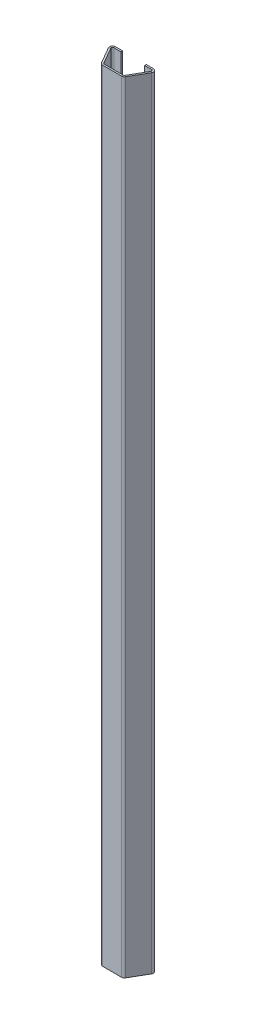
ISO-10303-21;
HEADER;
FILE_DESCRIPTION(('STEP AP214'),'2;1');
FILE_NAME('part.step','',(''),(''),'','','');
FILE_SCHEMA(('AUTOMOTIVE_DESIGN { 1 0 10303 214 1 1 1 1 }'));
ENDSEC;
DATA;
#1=APPLICATION_CONTEXT('core data for automotive mechanical design processes');
#2=APPLICATION_PROTOCOL_DEFINITION('international standard','automotive_design',2000,#1);
#3=PRODUCT_CONTEXT('',#1,'mechanical');
#4=PRODUCT('Part','Part','',(#3));
#5=PRODUCT_RELATED_PRODUCT_CATEGORY('part','',(#4));
#6=PRODUCT_DEFINITION_FORMATION('','',#4);
#7=PRODUCT_DEFINITION_CONTEXT('part definition',#1,'design');
#8=PRODUCT_DEFINITION('design','',#6,#7);
#9=PRODUCT_DEFINITION_SHAPE('','',#8);
#10=(LENGTH_UNIT() NAMED_UNIT(*) SI_UNIT(.MILLI.,.METRE.));
#11=(NAMED_UNIT(*) PLANE_ANGLE_UNIT() SI_UNIT($,.RADIAN.));
#12=(NAMED_UNIT(*) SI_UNIT($,.STERADIAN.) SOLID_ANGLE_UNIT());
#13=UNCERTAINTY_MEASURE_WITH_UNIT(LENGTH_MEASURE(1.E-05),#10,'distance_accuracy_value','');
#14=(GEOMETRIC_REPRESENTATION_CONTEXT(3) GLOBAL_UNCERTAINTY_ASSIGNED_CONTEXT((#13)) GLOBAL_UNIT_ASSIGNED_CONTEXT((#10,
#11,#12)) REPRESENTATION_CONTEXT('',''));
#15=CARTESIAN_POINT('',(0.,0.,0.));
#16=DIRECTION('',(0.,0.,1.));
#17=DIRECTION('',(1.,0.,0.));
#18=AXIS2_PLACEMENT_3D('',#15,#16,#17);
#19=CARTESIAN_POINT('',(-43.9170962313451,1810.,-52.0333209967908));
#20=DIRECTION('',(0.,1.,0.));
#21=DIRECTION('',(0.,0.,1.));
#22=AXIS2_PLACEMENT_3D('',#19,#20,#21);
#23=PLANE('',#22);
#24=DIRECTION('',(0.,0.,1.));
#25=VECTOR('',#24,1.);
#26=CARTESIAN_POINT('',(-43.9170962313451,1810.,-52.0333209967908));
#27=LINE('',#26,#25);
#28=CARTESIAN_POINT('',(-43.9170962313451,1810.,-52.0333209967908));
#29=VERTEX_POINT('',#28);
#30=CARTESIAN_POINT('',(-43.9170962313451,1810.,-48.0333209967908));
#31=VERTEX_POINT('',#30);
#32=EDGE_CURVE('E11',#29,#31,#27,.T.);
#33=ORIENTED_EDGE('',*,*,#32,.F.);
#34=CARTESIAN_POINT('',(-43.9170962313451,1810.,-45.0333209967908));
#35=DIRECTION('',(0.,-1.,0.));
#36=DIRECTION('',(0.,0.,-1.));
#37=AXIS2_PLACEMENT_3D('',#34,#35,#36);
#38=CIRCLE('',#37,7.);
#39=CARTESIAN_POINT('',(-49.9792740578362,1810.,-41.5333209967909));
#40=VERTEX_POINT('',#39);
#41=EDGE_CURVE('E362',#40,#29,#38,.T.);
#42=ORIENTED_EDGE('',*,*,#41,.F.);
#43=DIRECTION('',(-0.866025403784439,0.,0.499999999999999));
#44=VECTOR('',#43,1.);
#45=CARTESIAN_POINT('',(-46.5151724426984,1810.,-43.5333209967908));
#46=LINE('',#45,#44);
#47=CARTESIAN_POINT('',(-46.5151724426984,1810.,-43.5333209967908));
#48=VERTEX_POINT('',#47);
#49=EDGE_CURVE('E49',#48,#40,#46,.T.);
#50=ORIENTED_EDGE('',*,*,#49,.F.);
#51=CARTESIAN_POINT('',(-43.9170962313451,1810.,-45.0333209967908));
#52=DIRECTION('',(0.,1.,0.));
#53=DIRECTION('',(1.,0.,0.));
#54=AXIS2_PLACEMENT_3D('',#51,#52,#53);
#55=CIRCLE('',#54,3.);
#56=EDGE_CURVE('E221',#48,#31,#55,.F.);
#57=ORIENTED_EDGE('',*,*,#56,.T.);
#58=EDGE_LOOP('',(#33,#42,#50,#57));
#59=FACE_BOUND('',#58,.T.);
#60=ADVANCED_FACE('F41',(#59),#23,.T.);
#61=CARTESIAN_POINT('',(-46.5151724426984,1810.,-43.5333209967908));
#62=DIRECTION('',(0.,1.,0.));
#63=DIRECTION('',(0.,0.,1.));
#64=AXIS2_PLACEMENT_3D('',#61,#62,#63);
#65=PLANE('',#64);
#66=DIRECTION('',(1.,0.,0.));
#67=VECTOR('',#66,1.);
#68=CARTESIAN_POINT('',(-43.9170962313451,1810.,-52.0333209967908));
#69=LINE('',#68,#67);
#70=CARTESIAN_POINT('',(-27.5,1810.,-52.0333209967908));
#71=VERTEX_POINT('',#70);
#72=EDGE_CURVE('E366',#29,#71,#69,.T.);
#73=ORIENTED_EDGE('',*,*,#72,.F.);
#74=ORIENTED_EDGE('',*,*,#32,.T.);
#75=DIRECTION('',(1.,0.,0.));
#76=VECTOR('',#75,1.);
#77=CARTESIAN_POINT('',(-43.9170962313451,1810.,-48.0333209967908));
#78=LINE('',#77,#76);
#79=CARTESIAN_POINT('',(-27.5,1810.,-48.0333209967908));
#80=VERTEX_POINT('',#79);
#81=EDGE_CURVE('E133',#31,#80,#78,.T.);
#82=ORIENTED_EDGE('',*,*,#81,.T.);
#83=DIRECTION('',(0.,0.,1.));
#84=VECTOR('',#83,1.);
#85=CARTESIAN_POINT('',(-27.5,1810.,-52.0333209967908));
#86=LINE('',#85,#84);
#87=EDGE_CURVE('E880',#71,#80,#86,.T.);
#88=ORIENTED_EDGE('',*,*,#87,.F.);
#89=EDGE_LOOP('',(#73,#74,#82,#88));
#90=FACE_BOUND('',#89,.T.);
#91=ADVANCED_FACE('F495',(#90),#65,.T.);
#92=CARTESIAN_POINT('',(-49.9792740578362,0.,-41.5333209967909));
#93=DIRECTION('',(0.,-1.,0.));
#94=DIRECTION('',(0.,0.,-1.));
#95=AXIS2_PLACEMENT_3D('',#92,#93,#94);
#96=PLANE('',#95);
#97=DIRECTION('',(0.866025403784439,0.,-0.499999999999999));
#98=VECTOR('',#97,1.);
#99=CARTESIAN_POINT('',(-49.9792740578362,0.,-41.5333209967909));
#100=LINE('',#99,#98);
#101=CARTESIAN_POINT('',(-49.9792740578362,0.,-41.5333209967909));
#102=VERTEX_POINT('',#101);
#103=CARTESIAN_POINT('',(-46.5151724426984,0.,-43.5333209967908));
#104=VERTEX_POINT('',#103);
#105=EDGE_CURVE('E120',#102,#104,#100,.T.);
#106=ORIENTED_EDGE('',*,*,#105,.F.);
#107=CARTESIAN_POINT('',(-43.9170962313451,0.,-45.0333209967908));
#108=DIRECTION('',(0.,-1.,0.));
#109=DIRECTION('',(0.,0.,-1.));
#110=AXIS2_PLACEMENT_3D('',#107,#108,#109);
#111=CIRCLE('',#110,7.);
#112=CARTESIAN_POINT('',(-43.9170962313451,0.,-52.0333209967908));
#113=VERTEX_POINT('',#112);
#114=EDGE_CURVE('E236',#102,#113,#111,.T.);
#115=ORIENTED_EDGE('',*,*,#114,.T.);
#116=DIRECTION('',(0.,0.,-1.));
#117=VECTOR('',#116,1.);
#118=CARTESIAN_POINT('',(-43.9170962313451,0.,-48.0333209967908));
#119=LINE('',#118,#117);
#120=CARTESIAN_POINT('',(-43.9170962313451,0.,-48.0333209967908));
#121=VERTEX_POINT('',#120);
#122=EDGE_CURVE('E127',#121,#113,#119,.T.);
#123=ORIENTED_EDGE('',*,*,#122,.F.);
#124=CARTESIAN_POINT('',(-43.9170962313451,0.,-45.0333209967908));
#125=DIRECTION('',(0.,1.,0.));
#126=DIRECTION('',(1.,0.,0.));
#127=AXIS2_PLACEMENT_3D('',#124,#125,#126);
#128=CIRCLE('',#127,3.);
#129=EDGE_CURVE('E279',#104,#121,#128,.F.);
#130=ORIENTED_EDGE('',*,*,#129,.F.);
#131=EDGE_LOOP('',(#106,#115,#123,#130));
#132=FACE_BOUND('',#131,.T.);
#133=ADVANCED_FACE('F499',(#132),#96,.T.);
#134=CARTESIAN_POINT('',(-43.9170962313451,0.,-48.0333209967908));
#135=DIRECTION('',(0.,-1.,0.));
#136=DIRECTION('',(0.,0.,-1.));
#137=AXIS2_PLACEMENT_3D('',#134,#135,#136);
#138=PLANE('',#137);
#139=DIRECTION('',(-0.499999999999998,0.,-0.86602540378444));
#140=VECTOR('',#139,1.);
#141=CARTESIAN_POINT('',(-28.0207259421637,0.,-3.50000000000001));
#142=LINE('',#141,#140);
#143=CARTESIAN_POINT('',(-28.0207259421637,0.,-3.50000000000001));
#144=VERTEX_POINT('',#143);
#145=EDGE_CURVE('E238',#144,#102,#142,.T.);
#146=ORIENTED_EDGE('',*,*,#145,.T.);
#147=ORIENTED_EDGE('',*,*,#105,.T.);
#148=DIRECTION('',(-0.499999999999998,0.,-0.86602540378444));
#149=VECTOR('',#148,1.);
#150=CARTESIAN_POINT('',(-24.5566243270259,0.,-5.50000000000001));
#151=LINE('',#150,#149);
#152=CARTESIAN_POINT('',(-24.5566243270259,0.,-5.50000000000001));
#153=VERTEX_POINT('',#152);
#154=EDGE_CURVE('E277',#153,#104,#151,.T.);
#155=ORIENTED_EDGE('',*,*,#154,.F.);
#156=DIRECTION('',(-0.86602540378444,0.,0.499999999999998));
#157=VECTOR('',#156,1.);
#158=CARTESIAN_POINT('',(-24.5566243270259,0.,-5.50000000000001));
#159=LINE('',#158,#157);
#160=EDGE_CURVE('E349',#153,#144,#159,.T.);
#161=ORIENTED_EDGE('',*,*,#160,.T.);
#162=EDGE_LOOP('',(#146,#147,#155,#161));
#163=FACE_BOUND('',#162,.T.);
#164=ADVANCED_FACE('F415',(#163),#138,.T.);
#165=CARTESIAN_POINT('',(-28.0207259421637,1810.,-3.50000000000001));
#166=DIRECTION('',(0.,1.,0.));
#167=DIRECTION('',(0.,0.,1.));
#168=AXIS2_PLACEMENT_3D('',#165,#166,#167);
#169=PLANE('',#168);
#170=DIRECTION('',(0.86602540378444,0.,-0.499999999999998));
#171=VECTOR('',#170,1.);
#172=CARTESIAN_POINT('',(-28.0207259421637,1810.,-3.50000000000001));
#173=LINE('',#172,#171);
#174=CARTESIAN_POINT('',(-28.0207259421637,1810.,-3.50000000000001));
#175=VERTEX_POINT('',#174);
#176=CARTESIAN_POINT('',(-24.5566243270259,1810.,-5.50000000000001));
#177=VERTEX_POINT('',#176);
#178=EDGE_CURVE('E185',#175,#177,#173,.T.);
#179=ORIENTED_EDGE('',*,*,#178,.F.);
#180=CARTESIAN_POINT('',(-21.9585481156726,1810.,-7.));
#181=DIRECTION('',(0.,-1.,0.));
#182=DIRECTION('',(0.,0.,-1.));
#183=AXIS2_PLACEMENT_3D('',#180,#181,#182);
#184=CIRCLE('',#183,7.);
#185=CARTESIAN_POINT('',(-21.9585481156726,1810.,0.));
#186=VERTEX_POINT('',#185);
#187=EDGE_CURVE('E369',#186,#175,#184,.T.);
#188=ORIENTED_EDGE('',*,*,#187,.F.);
#189=DIRECTION('',(0.,0.,1.));
#190=VECTOR('',#189,1.);
#191=CARTESIAN_POINT('',(-21.9585481156726,1810.,-4.));
#192=LINE('',#191,#190);
#193=CARTESIAN_POINT('',(-21.9585481156726,1810.,-4.));
#194=VERTEX_POINT('',#193);
#195=EDGE_CURVE('E197',#194,#186,#192,.T.);
#196=ORIENTED_EDGE('',*,*,#195,.F.);
#197=CARTESIAN_POINT('',(-21.9585481156726,1810.,-7.));
#198=DIRECTION('',(0.,1.,0.));
#199=DIRECTION('',(1.,0.,0.));
#200=AXIS2_PLACEMENT_3D('',#197,#198,#199);
#201=CIRCLE('',#200,3.);
#202=EDGE_CURVE('E200',#194,#177,#201,.F.);
#203=ORIENTED_EDGE('',*,*,#202,.T.);
#204=EDGE_LOOP('',(#179,#188,#196,#203));
#205=FACE_BOUND('',#204,.T.);
#206=ADVANCED_FACE('F202',(#205),#169,.T.);
#207=CARTESIAN_POINT('',(-21.9585481156726,1810.,-4.));
#208=DIRECTION('',(0.,1.,0.));
#209=DIRECTION('',(0.,0.,1.));
#210=AXIS2_PLACEMENT_3D('',#207,#208,#209);
#211=PLANE('',#210);
#212=DIRECTION('',(-0.499999999999998,0.,-0.86602540378444));
#213=VECTOR('',#212,1.);
#214=CARTESIAN_POINT('',(-28.0207259421637,1810.,-3.50000000000001));
#215=LINE('',#214,#213);
#216=EDGE_CURVE('E192',#175,#40,#215,.T.);
#217=ORIENTED_EDGE('',*,*,#216,.F.);
#218=ORIENTED_EDGE('',*,*,#178,.T.);
#219=DIRECTION('',(-0.499999999999998,0.,-0.86602540378444));
#220=VECTOR('',#219,1.);
#221=CARTESIAN_POINT('',(-24.5566243270259,1810.,-5.50000000000001));
#222=LINE('',#221,#220);
#223=EDGE_CURVE('E189',#177,#48,#222,.T.);
#224=ORIENTED_EDGE('',*,*,#223,.T.);
#225=ORIENTED_EDGE('',*,*,#49,.T.);
#226=EDGE_LOOP('',(#217,#218,#224,#225));
#227=FACE_BOUND('',#226,.T.);
#228=ADVANCED_FACE('F187',(#227),#211,.T.);
#229=CARTESIAN_POINT('',(-21.9585481156726,0.,0.));
#230=DIRECTION('',(0.,-1.,0.));
#231=DIRECTION('',(0.,0.,-1.));
#232=AXIS2_PLACEMENT_3D('',#229,#230,#231);
#233=PLANE('',#232);
#234=DIRECTION('',(0.,0.,-1.));
#235=VECTOR('',#234,1.);
#236=CARTESIAN_POINT('',(-21.9585481156726,0.,0.));
#237=LINE('',#236,#235);
#238=CARTESIAN_POINT('',(-21.9585481156726,0.,0.));
#239=VERTEX_POINT('',#238);
#240=CARTESIAN_POINT('',(-21.9585481156726,0.,-4.));
#241=VERTEX_POINT('',#240);
#242=EDGE_CURVE('E351',#239,#241,#237,.T.);
#243=ORIENTED_EDGE('',*,*,#242,.F.);
#244=CARTESIAN_POINT('',(-21.9585481156726,0.,-7.));
#245=DIRECTION('',(0.,-1.,0.));
#246=DIRECTION('',(0.,0.,-1.));
#247=AXIS2_PLACEMENT_3D('',#244,#245,#246);
#248=CIRCLE('',#247,7.);
#249=EDGE_CURVE('E240',#239,#144,#248,.T.);
#250=ORIENTED_EDGE('',*,*,#249,.T.);
#251=ORIENTED_EDGE('',*,*,#160,.F.);
#252=CARTESIAN_POINT('',(-21.9585481156726,0.,-7.));
#253=DIRECTION('',(0.,1.,0.));
#254=DIRECTION('',(1.,0.,0.));
#255=AXIS2_PLACEMENT_3D('',#252,#253,#254);
#256=CIRCLE('',#255,3.);
#257=EDGE_CURVE('E213',#241,#153,#256,.F.);
#258=ORIENTED_EDGE('',*,*,#257,.F.);
#259=EDGE_LOOP('',(#243,#250,#251,#258));
#260=FACE_BOUND('',#259,.T.);
#261=ADVANCED_FACE('F413',(#260),#233,.T.);
#262=CARTESIAN_POINT('',(-24.5566243270259,0.,-5.50000000000001));
#263=DIRECTION('',(0.,-1.,0.));
#264=DIRECTION('',(0.,0.,-1.));
#265=AXIS2_PLACEMENT_3D('',#262,#263,#264);
#266=PLANE('',#265);
#267=DIRECTION('',(-1.,0.,0.));
#268=VECTOR('',#267,1.);
#269=CARTESIAN_POINT('',(-21.9585481156726,0.,0.));
#270=LINE('',#269,#268);
#271=CARTESIAN_POINT('',(21.9585481156726,0.,0.));
#272=VERTEX_POINT('',#271);
#273=EDGE_CURVE('E243',#272,#239,#270,.T.);
#274=ORIENTED_EDGE('',*,*,#273,.T.);
#275=ORIENTED_EDGE('',*,*,#242,.T.);
#276=DIRECTION('',(-1.,0.,0.));
#277=VECTOR('',#276,1.);
#278=CARTESIAN_POINT('',(-21.9585481156726,0.,-4.));
#279=LINE('',#278,#277);
#280=CARTESIAN_POINT('',(21.9585481156726,0.,-4.00000000000001));
#281=VERTEX_POINT('',#280);
#282=EDGE_CURVE('E273',#281,#241,#279,.T.);
#283=ORIENTED_EDGE('',*,*,#282,.F.);
#284=DIRECTION('',(0.,0.,1.));
#285=VECTOR('',#284,1.);
#286=CARTESIAN_POINT('',(21.9585481156726,0.,-4.00000000000001));
#287=LINE('',#286,#285);
#288=EDGE_CURVE('E341',#281,#272,#287,.T.);
#289=ORIENTED_EDGE('',*,*,#288,.T.);
#290=EDGE_LOOP('',(#274,#275,#283,#289));
#291=FACE_BOUND('',#290,.T.);
#292=ADVANCED_FACE('F474',(#291),#266,.T.);
#293=CARTESIAN_POINT('',(21.9585481156726,1810.,0.));
#294=DIRECTION('',(0.,1.,0.));
#295=DIRECTION('',(0.,0.,1.));
#296=AXIS2_PLACEMENT_3D('',#293,#294,#295);
#297=PLANE('',#296);
#298=DIRECTION('',(0.,0.,-1.));
#299=VECTOR('',#298,1.);
#300=CARTESIAN_POINT('',(21.9585481156726,1810.,0.));
#301=LINE('',#300,#299);
#302=CARTESIAN_POINT('',(21.9585481156726,1810.,0.));
#303=VERTEX_POINT('',#302);
#304=CARTESIAN_POINT('',(21.9585481156726,1810.,-4.00000000000001));
#305=VERTEX_POINT('',#304);
#306=EDGE_CURVE('E347',#303,#305,#301,.T.);
#307=ORIENTED_EDGE('',*,*,#306,.F.);
#308=CARTESIAN_POINT('',(21.9585481156726,1810.,-7.00000000000001));
#309=DIRECTION('',(0.,-1.,0.));
#310=DIRECTION('',(0.,0.,-1.));
#311=AXIS2_PLACEMENT_3D('',#308,#309,#310);
#312=CIRCLE('',#311,7.);
#313=CARTESIAN_POINT('',(28.0207259421637,1810.,-3.50000000000002));
#314=VERTEX_POINT('',#313);
#315=EDGE_CURVE('E377',#314,#303,#312,.T.);
#316=ORIENTED_EDGE('',*,*,#315,.F.);
#317=DIRECTION('',(0.86602540378444,0.,0.499999999999998));
#318=VECTOR('',#317,1.);
#319=CARTESIAN_POINT('',(24.5566243270259,1810.,-5.50000000000001));
#320=LINE('',#319,#318);
#321=CARTESIAN_POINT('',(24.5566243270259,1810.,-5.50000000000001));
#322=VERTEX_POINT('',#321);
#323=EDGE_CURVE('E345',#322,#314,#320,.T.);
#324=ORIENTED_EDGE('',*,*,#323,.F.);
#325=CARTESIAN_POINT('',(21.9585481156726,1810.,-7.00000000000001));
#326=DIRECTION('',(0.,1.,0.));
#327=DIRECTION('',(1.,0.,0.));
#328=AXIS2_PLACEMENT_3D('',#325,#326,#327);
#329=CIRCLE('',#328,3.);
#330=EDGE_CURVE('E401',#322,#305,#329,.F.);
#331=ORIENTED_EDGE('',*,*,#330,.T.);
#332=EDGE_LOOP('',(#307,#316,#324,#331));
#333=FACE_BOUND('',#332,.T.);
#334=ADVANCED_FACE('F428',(#333),#297,.T.);
#335=CARTESIAN_POINT('',(24.5566243270259,1810.,-5.50000000000001));
#336=DIRECTION('',(0.,1.,0.));
#337=DIRECTION('',(0.,0.,1.));
#338=AXIS2_PLACEMENT_3D('',#335,#336,#337);
#339=PLANE('',#338);
#340=DIRECTION('',(-1.,0.,0.));
#341=VECTOR('',#340,1.);
#342=CARTESIAN_POINT('',(-21.9585481156726,1810.,0.));
#343=LINE('',#342,#341);
#344=EDGE_CURVE('E371',#303,#186,#343,.T.);
#345=ORIENTED_EDGE('',*,*,#344,.F.);
#346=ORIENTED_EDGE('',*,*,#306,.T.);
#347=DIRECTION('',(-1.,0.,0.));
#348=VECTOR('',#347,1.);
#349=CARTESIAN_POINT('',(-21.9585481156726,1810.,-4.));
#350=LINE('',#349,#348);
#351=EDGE_CURVE('E206',#305,#194,#350,.T.);
#352=ORIENTED_EDGE('',*,*,#351,.T.);
#353=ORIENTED_EDGE('',*,*,#195,.T.);
#354=EDGE_LOOP('',(#345,#346,#352,#353));
#355=FACE_BOUND('',#354,.T.);
#356=ADVANCED_FACE('F407',(#355),#339,.T.);
#357=CARTESIAN_POINT('',(28.0207259421637,0.,-3.50000000000002));
#358=DIRECTION('',(0.,-1.,0.));
#359=DIRECTION('',(0.,0.,-1.));
#360=AXIS2_PLACEMENT_3D('',#357,#358,#359);
#361=PLANE('',#360);
#362=DIRECTION('',(-0.86602540378444,0.,-0.499999999999998));
#363=VECTOR('',#362,1.);
#364=CARTESIAN_POINT('',(28.0207259421637,0.,-3.50000000000002));
#365=LINE('',#364,#363);
#366=CARTESIAN_POINT('',(28.0207259421637,0.,-3.50000000000002));
#367=VERTEX_POINT('',#366);
#368=CARTESIAN_POINT('',(24.5566243270259,0.,-5.50000000000001));
#369=VERTEX_POINT('',#368);
#370=EDGE_CURVE('E343',#367,#369,#365,.T.);
#371=ORIENTED_EDGE('',*,*,#370,.F.);
#372=CARTESIAN_POINT('',(21.9585481156726,0.,-7.00000000000001));
#373=DIRECTION('',(0.,-1.,0.));
#374=DIRECTION('',(0.,0.,-1.));
#375=AXIS2_PLACEMENT_3D('',#372,#373,#374);
#376=CIRCLE('',#375,7.);
#377=EDGE_CURVE('E246',#367,#272,#376,.T.);
#378=ORIENTED_EDGE('',*,*,#377,.T.);
#379=ORIENTED_EDGE('',*,*,#288,.F.);
#380=CARTESIAN_POINT('',(21.9585481156726,0.,-7.00000000000001));
#381=DIRECTION('',(0.,1.,0.));
#382=DIRECTION('',(1.,0.,0.));
#383=AXIS2_PLACEMENT_3D('',#380,#381,#382);
#384=CIRCLE('',#383,3.);
#385=EDGE_CURVE('E270',#369,#281,#384,.F.);
#386=ORIENTED_EDGE('',*,*,#385,.F.);
#387=EDGE_LOOP('',(#371,#378,#379,#386));
#388=FACE_BOUND('',#387,.T.);
#389=ADVANCED_FACE('F476',(#388),#361,.T.);
#390=CARTESIAN_POINT('',(21.9585481156726,0.,-4.00000000000001));
#391=DIRECTION('',(0.,-1.,0.));
#392=DIRECTION('',(0.,0.,-1.));
#393=AXIS2_PLACEMENT_3D('',#390,#391,#392);
#394=PLANE('',#393);
#395=DIRECTION('',(-0.499999999999998,0.,0.86602540378444));
#396=VECTOR('',#395,1.);
#397=CARTESIAN_POINT('',(28.0207259421637,0.,-3.50000000000002));
#398=LINE('',#397,#396);
#399=CARTESIAN_POINT('',(49.9792740578362,0.,-41.5333209967909));
#400=VERTEX_POINT('',#399);
#401=EDGE_CURVE('E249',#400,#367,#398,.T.);
#402=ORIENTED_EDGE('',*,*,#401,.T.);
#403=ORIENTED_EDGE('',*,*,#370,.T.);
#404=DIRECTION('',(-0.499999999999998,0.,0.86602540378444));
#405=VECTOR('',#404,1.);
#406=CARTESIAN_POINT('',(24.5566243270259,0.,-5.50000000000001));
#407=LINE('',#406,#405);
#408=CARTESIAN_POINT('',(46.5151724426985,0.,-43.5333209967909));
#409=VERTEX_POINT('',#408);
#410=EDGE_CURVE('E267',#409,#369,#407,.T.);
#411=ORIENTED_EDGE('',*,*,#410,.F.);
#412=DIRECTION('',(0.866025403784438,0.,0.500000000000001));
#413=VECTOR('',#412,1.);
#414=CARTESIAN_POINT('',(46.5151724426985,0.,-43.5333209967909));
#415=LINE('',#414,#413);
#416=EDGE_CURVE('E333',#409,#400,#415,.T.);
#417=ORIENTED_EDGE('',*,*,#416,.T.);
#418=EDGE_LOOP('',(#402,#403,#411,#417));
#419=FACE_BOUND('',#418,.T.);
#420=ADVANCED_FACE('F478',(#419),#394,.T.);
#421=CARTESIAN_POINT('',(49.9792740578362,1810.,-41.5333209967909));
#422=DIRECTION('',(0.,1.,0.));
#423=DIRECTION('',(0.,0.,1.));
#424=AXIS2_PLACEMENT_3D('',#421,#422,#423);
#425=PLANE('',#424);
#426=DIRECTION('',(-0.866025403784438,0.,-0.500000000000001));
#427=VECTOR('',#426,1.);
#428=CARTESIAN_POINT('',(49.9792740578362,1810.,-41.5333209967909));
#429=LINE('',#428,#427);
#430=CARTESIAN_POINT('',(49.9792740578362,1810.,-41.5333209967909));
#431=VERTEX_POINT('',#430);
#432=CARTESIAN_POINT('',(46.5151724426985,1810.,-43.5333209967909));
#433=VERTEX_POINT('',#432);
#434=EDGE_CURVE('E339',#431,#433,#429,.T.);
#435=ORIENTED_EDGE('',*,*,#434,.F.);
#436=CARTESIAN_POINT('',(43.9170962313451,1810.,-45.0333209967909));
#437=DIRECTION('',(0.,-1.,0.));
#438=DIRECTION('',(0.,0.,-1.));
#439=AXIS2_PLACEMENT_3D('',#436,#437,#438);
#440=CIRCLE('',#439,7.00000000000001);
#441=CARTESIAN_POINT('',(43.9170962313451,1810.,-52.0333209967909));
#442=VERTEX_POINT('',#441);
#443=EDGE_CURVE('E383',#442,#431,#440,.T.);
#444=ORIENTED_EDGE('',*,*,#443,.F.);
#445=DIRECTION('',(0.,0.,-1.));
#446=VECTOR('',#445,1.);
#447=CARTESIAN_POINT('',(43.9170962313451,1810.,-48.0333209967909));
#448=LINE('',#447,#446);
#449=CARTESIAN_POINT('',(43.9170962313451,1810.,-48.0333209967909));
#450=VERTEX_POINT('',#449);
#451=EDGE_CURVE('E337',#450,#442,#448,.T.);
#452=ORIENTED_EDGE('',*,*,#451,.F.);
#453=CARTESIAN_POINT('',(43.9170962313451,1810.,-45.0333209967909));
#454=DIRECTION('',(0.,1.,0.));
#455=DIRECTION('',(1.,0.,0.));
#456=AXIS2_PLACEMENT_3D('',#453,#454,#455);
#457=CIRCLE('',#456,3.00000000000001);
#458=EDGE_CURVE('E395',#450,#433,#457,.F.);
#459=ORIENTED_EDGE('',*,*,#458,.T.);
#460=EDGE_LOOP('',(#435,#444,#452,#459));
#461=FACE_BOUND('',#460,.T.);
#462=ADVANCED_FACE('F442',(#461),#425,.T.);
#463=CARTESIAN_POINT('',(43.9170962313451,1810.,-48.0333209967909));
#464=DIRECTION('',(0.,1.,0.));
#465=DIRECTION('',(0.,0.,1.));
#466=AXIS2_PLACEMENT_3D('',#463,#464,#465);
#467=PLANE('',#466);
#468=DIRECTION('',(-0.499999999999998,0.,0.86602540378444));
#469=VECTOR('',#468,1.);
#470=CARTESIAN_POINT('',(28.0207259421637,1810.,-3.50000000000002));
#471=LINE('',#470,#469);
#472=EDGE_CURVE('E380',#431,#314,#471,.T.);
#473=ORIENTED_EDGE('',*,*,#472,.F.);
#474=ORIENTED_EDGE('',*,*,#434,.T.);
#475=DIRECTION('',(-0.499999999999998,0.,0.86602540378444));
#476=VECTOR('',#475,1.);
#477=CARTESIAN_POINT('',(24.5566243270259,1810.,-5.50000000000001));
#478=LINE('',#477,#476);
#479=EDGE_CURVE('E398',#433,#322,#478,.T.);
#480=ORIENTED_EDGE('',*,*,#479,.T.);
#481=ORIENTED_EDGE('',*,*,#323,.T.);
#482=EDGE_LOOP('',(#473,#474,#480,#481));
#483=FACE_BOUND('',#482,.T.);
#484=ADVANCED_FACE('F435',(#483),#467,.T.);
#485=CARTESIAN_POINT('',(43.9170962313451,0.,-52.0333209967909));
#486=DIRECTION('',(0.,-1.,0.));
#487=DIRECTION('',(0.,0.,-1.));
#488=AXIS2_PLACEMENT_3D('',#485,#486,#487);
#489=PLANE('',#488);
#490=DIRECTION('',(0.,0.,1.));
#491=VECTOR('',#490,1.);
#492=CARTESIAN_POINT('',(43.9170962313451,0.,-52.0333209967909));
#493=LINE('',#492,#491);
#494=CARTESIAN_POINT('',(43.9170962313451,0.,-52.0333209967909));
#495=VERTEX_POINT('',#494);
#496=CARTESIAN_POINT('',(43.9170962313451,0.,-48.0333209967909));
#497=VERTEX_POINT('',#496);
#498=EDGE_CURVE('E335',#495,#497,#493,.T.);
#499=ORIENTED_EDGE('',*,*,#498,.F.);
#500=CARTESIAN_POINT('',(43.9170962313451,0.,-45.0333209967909));
#501=DIRECTION('',(0.,-1.,0.));
#502=DIRECTION('',(0.,0.,-1.));
#503=AXIS2_PLACEMENT_3D('',#500,#501,#502);
#504=CIRCLE('',#503,7.00000000000001);
#505=EDGE_CURVE('E252',#495,#400,#504,.T.);
#506=ORIENTED_EDGE('',*,*,#505,.T.);
#507=ORIENTED_EDGE('',*,*,#416,.F.);
#508=CARTESIAN_POINT('',(43.9170962313451,0.,-45.0333209967909));
#509=DIRECTION('',(0.,1.,0.));
#510=DIRECTION('',(1.,0.,0.));
#511=AXIS2_PLACEMENT_3D('',#508,#509,#510);
#512=CIRCLE('',#511,3.00000000000001);
#513=EDGE_CURVE('E264',#497,#409,#512,.F.);
#514=ORIENTED_EDGE('',*,*,#513,.F.);
#515=EDGE_LOOP('',(#499,#506,#507,#514));
#516=FACE_BOUND('',#515,.T.);
#517=ADVANCED_FACE('F480',(#516),#489,.T.);
#518=CARTESIAN_POINT('',(46.5151724426985,0.,-43.5333209967909));
#519=DIRECTION('',(0.,-1.,0.));
#520=DIRECTION('',(0.,0.,-1.));
#521=AXIS2_PLACEMENT_3D('',#518,#519,#520);
#522=PLANE('',#521);
#523=DIRECTION('',(1.,0.,0.));
#524=VECTOR('',#523,1.);
#525=CARTESIAN_POINT('',(27.5,0.,-52.0333209967908));
#526=LINE('',#525,#524);
#527=CARTESIAN_POINT('',(27.5,0.,-52.0333209967908));
#528=VERTEX_POINT('',#527);
#529=EDGE_CURVE('E255',#528,#495,#526,.T.);
#530=ORIENTED_EDGE('',*,*,#529,.T.);
#531=ORIENTED_EDGE('',*,*,#498,.T.);
#532=DIRECTION('',(1.,0.,0.));
#533=VECTOR('',#532,1.);
#534=CARTESIAN_POINT('',(27.5,0.,-48.0333209967908));
#535=LINE('',#534,#533);
#536=CARTESIAN_POINT('',(27.5,0.,-48.0333209967908));
#537=VERTEX_POINT('',#536);
#538=EDGE_CURVE('E261',#537,#497,#535,.T.);
#539=ORIENTED_EDGE('',*,*,#538,.F.);
#540=DIRECTION('',(0.,0.,-1.));
#541=VECTOR('',#540,1.);
#542=CARTESIAN_POINT('',(27.5,0.,-48.0333209967908));
#543=LINE('',#542,#541);
#544=EDGE_CURVE('E258',#537,#528,#543,.T.);
#545=ORIENTED_EDGE('',*,*,#544,.T.);
#546=EDGE_LOOP('',(#530,#531,#539,#545));
#547=FACE_BOUND('',#546,.T.);
#548=ADVANCED_FACE('F482',(#547),#522,.T.);
#549=CARTESIAN_POINT('',(-43.9170962313451,1810.,-48.0333209967908));
#550=DIRECTION('',(0.,0.,-1.));
#551=DIRECTION('',(-1.,0.,0.));
#552=AXIS2_PLACEMENT_3D('',#549,#550,#551);
#553=PLANE('',#552);
#554=DIRECTION('',(1.,0.,0.));
#555=VECTOR('',#554,1.);
#556=CARTESIAN_POINT('',(-43.9170962313451,0.,-48.0333209967908));
#557=LINE('',#556,#555);
#558=CARTESIAN_POINT('',(-27.5,0.,-48.0333209967908));
#559=VERTEX_POINT('',#558);
#560=EDGE_CURVE('E227',#121,#559,#557,.T.);
#561=ORIENTED_EDGE('',*,*,#560,.T.);
#562=DIRECTION('',(0.,-1.,0.));
#563=VECTOR('',#562,1.);
#564=CARTESIAN_POINT('',(-27.5,1810.,-48.0333209967908));
#565=LINE('',#564,#563);
#566=EDGE_CURVE('E331',#80,#559,#565,.T.);
#567=ORIENTED_EDGE('',*,*,#566,.F.);
#568=ORIENTED_EDGE('',*,*,#81,.F.);
#569=DIRECTION('',(0.,-1.,0.));
#570=VECTOR('',#569,1.);
#571=CARTESIAN_POINT('',(-43.9170962313451,1810.,-48.0333209967908));
#572=LINE('',#571,#570);
#573=EDGE_CURVE('E223',#31,#121,#572,.T.);
#574=ORIENTED_EDGE('',*,*,#573,.T.);
#575=EDGE_LOOP('',(#561,#567,#568,#574));
#576=FACE_BOUND('',#575,.T.);
#577=ADVANCED_FACE('F484',(#576),#553,.F.);
#578=CARTESIAN_POINT('',(-27.5,1810.,-52.0333209967908));
#579=DIRECTION('',(1.,0.,0.));
#580=DIRECTION('',(0.,0.,-1.));
#581=AXIS2_PLACEMENT_3D('',#578,#579,#580);
#582=PLANE('',#581);
#583=DIRECTION('',(0.,0.,1.));
#584=VECTOR('',#583,1.);
#585=CARTESIAN_POINT('',(-27.5,0.,-52.0333209967908));
#586=LINE('',#585,#584);
#587=CARTESIAN_POINT('',(-27.5,0.,-52.0333209967908));
#588=VERTEX_POINT('',#587);
#589=EDGE_CURVE('E230',#588,#559,#586,.T.);
#590=ORIENTED_EDGE('',*,*,#589,.F.);
#591=DIRECTION('',(0.,-1.,0.));
#592=VECTOR('',#591,1.);
#593=CARTESIAN_POINT('',(-27.5,1810.,-52.0333209967908));
#594=LINE('',#593,#592);
#595=EDGE_CURVE('E329',#71,#588,#594,.T.);
#596=ORIENTED_EDGE('',*,*,#595,.F.);
#597=ORIENTED_EDGE('',*,*,#87,.T.);
#598=ORIENTED_EDGE('',*,*,#566,.T.);
#599=EDGE_LOOP('',(#590,#596,#597,#598));
#600=FACE_BOUND('',#599,.T.);
#601=ADVANCED_FACE('F490',(#600),#582,.T.);
#602=CARTESIAN_POINT('',(-43.9170962313451,1810.,-52.0333209967908));
#603=DIRECTION('',(0.,0.,-1.));
#604=DIRECTION('',(-1.,0.,0.));
#605=AXIS2_PLACEMENT_3D('',#602,#603,#604);
#606=PLANE('',#605);
#607=DIRECTION('',(1.,0.,0.));
#608=VECTOR('',#607,1.);
#609=CARTESIAN_POINT('',(-43.9170962313451,0.,-52.0333209967908));
#610=LINE('',#609,#608);
#611=EDGE_CURVE('E233',#113,#588,#610,.T.);
#612=ORIENTED_EDGE('',*,*,#611,.F.);
#613=DIRECTION('',(0.,-1.,0.));
#614=VECTOR('',#613,1.);
#615=CARTESIAN_POINT('',(-43.9170962313451,1810.,-52.0333209967908));
#616=LINE('',#615,#614);
#617=EDGE_CURVE('E326',#29,#113,#616,.T.);
#618=ORIENTED_EDGE('',*,*,#617,.F.);
#619=ORIENTED_EDGE('',*,*,#72,.T.);
#620=ORIENTED_EDGE('',*,*,#595,.T.);
#621=EDGE_LOOP('',(#612,#618,#619,#620));
#622=FACE_BOUND('',#621,.T.);
#623=ADVANCED_FACE('F556',(#622),#606,.T.);
#624=CARTESIAN_POINT('',(-43.9170962313451,1810.,-45.0333209967908));
#625=DIRECTION('',(0.,-1.,0.));
#626=DIRECTION('',(0.,0.,-1.));
#627=AXIS2_PLACEMENT_3D('',#624,#625,#626);
#628=CYLINDRICAL_SURFACE('',#627,7.);
#629=ORIENTED_EDGE('',*,*,#114,.F.);
#630=DIRECTION('',(0.,-1.,0.));
#631=VECTOR('',#630,1.);
#632=CARTESIAN_POINT('',(-49.9792740578362,1810.,-41.5333209967909));
#633=LINE('',#632,#631);
#634=EDGE_CURVE('E323',#40,#102,#633,.T.);
#635=ORIENTED_EDGE('',*,*,#634,.F.);
#636=ORIENTED_EDGE('',*,*,#41,.T.);
#637=ORIENTED_EDGE('',*,*,#617,.T.);
#638=EDGE_LOOP('',(#629,#635,#636,#637));
#639=FACE_BOUND('',#638,.T.);
#640=ADVANCED_FACE('F361',(#639),#628,.T.);
#641=CARTESIAN_POINT('',(-28.0207259421637,1810.,-3.50000000000001));
#642=DIRECTION('',(-0.86602540378444,0.,0.499999999999998));
#643=DIRECTION('',(0.499999999999998,0.,0.86602540378444));
#644=AXIS2_PLACEMENT_3D('',#641,#642,#643);
#645=PLANE('',#644);
#646=ORIENTED_EDGE('',*,*,#145,.F.);
#647=DIRECTION('',(0.,-1.,0.));
#648=VECTOR('',#647,1.);
#649=CARTESIAN_POINT('',(-28.0207259421637,1810.,-3.50000000000001));
#650=LINE('',#649,#648);
#651=EDGE_CURVE('E320',#175,#144,#650,.T.);
#652=ORIENTED_EDGE('',*,*,#651,.F.);
#653=ORIENTED_EDGE('',*,*,#216,.T.);
#654=ORIENTED_EDGE('',*,*,#634,.T.);
#655=EDGE_LOOP('',(#646,#652,#653,#654));
#656=FACE_BOUND('',#655,.T.);
#657=ADVANCED_FACE('F368',(#656),#645,.T.);
#658=CARTESIAN_POINT('',(-21.9585481156726,1810.,-7.));
#659=DIRECTION('',(0.,-1.,0.));
#660=DIRECTION('',(0.,0.,-1.));
#661=AXIS2_PLACEMENT_3D('',#658,#659,#660);
#662=CYLINDRICAL_SURFACE('',#661,7.);
#663=ORIENTED_EDGE('',*,*,#249,.F.);
#664=DIRECTION('',(0.,-1.,0.));
#665=VECTOR('',#664,1.);
#666=CARTESIAN_POINT('',(-21.9585481156726,1810.,0.));
#667=LINE('',#666,#665);
#668=EDGE_CURVE('E317',#186,#239,#667,.T.);
#669=ORIENTED_EDGE('',*,*,#668,.F.);
#670=ORIENTED_EDGE('',*,*,#187,.T.);
#671=ORIENTED_EDGE('',*,*,#651,.T.);
#672=EDGE_LOOP('',(#663,#669,#670,#671));
#673=FACE_BOUND('',#672,.T.);
#674=ADVANCED_FACE('F417',(#673),#662,.T.);
#675=CARTESIAN_POINT('',(-21.9585481156726,1810.,0.));
#676=DIRECTION('',(0.,0.,1.));
#677=DIRECTION('',(1.,0.,0.));
#678=AXIS2_PLACEMENT_3D('',#675,#676,#677);
#679=PLANE('',#678);
#680=ORIENTED_EDGE('',*,*,#273,.F.);
#681=DIRECTION('',(0.,-1.,0.));
#682=VECTOR('',#681,1.);
#683=CARTESIAN_POINT('',(21.9585481156726,1810.,0.));
#684=LINE('',#683,#682);
#685=EDGE_CURVE('E313',#303,#272,#684,.T.);
#686=ORIENTED_EDGE('',*,*,#685,.F.);
#687=ORIENTED_EDGE('',*,*,#344,.T.);
#688=ORIENTED_EDGE('',*,*,#668,.T.);
#689=EDGE_LOOP('',(#680,#686,#687,#688));
#690=FACE_BOUND('',#689,.T.);
#691=ADVANCED_FACE('F421',(#690),#679,.T.);
#692=CARTESIAN_POINT('',(21.9585481156726,1810.,-7.00000000000001));
#693=DIRECTION('',(0.,-1.,0.));
#694=DIRECTION('',(0.,0.,-1.));
#695=AXIS2_PLACEMENT_3D('',#692,#693,#694);
#696=CYLINDRICAL_SURFACE('',#695,7.);
#697=ORIENTED_EDGE('',*,*,#377,.F.);
#698=DIRECTION('',(0.,-1.,0.));
#699=VECTOR('',#698,1.);
#700=CARTESIAN_POINT('',(28.0207259421637,1810.,-3.50000000000002));
#701=LINE('',#700,#699);
#702=EDGE_CURVE('E310',#314,#367,#701,.T.);
#703=ORIENTED_EDGE('',*,*,#702,.F.);
#704=ORIENTED_EDGE('',*,*,#315,.T.);
#705=ORIENTED_EDGE('',*,*,#685,.T.);
#706=EDGE_LOOP('',(#697,#703,#704,#705));
#707=FACE_BOUND('',#706,.T.);
#708=ADVANCED_FACE('F426',(#707),#696,.T.);
#709=CARTESIAN_POINT('',(28.0207259421637,1810.,-3.50000000000002));
#710=DIRECTION('',(0.86602540378444,0.,0.499999999999998));
#711=DIRECTION('',(0.499999999999998,0.,-0.86602540378444));
#712=AXIS2_PLACEMENT_3D('',#709,#710,#711);
#713=PLANE('',#712);
#714=ORIENTED_EDGE('',*,*,#401,.F.);
#715=DIRECTION('',(0.,-1.,0.));
#716=VECTOR('',#715,1.);
#717=CARTESIAN_POINT('',(49.9792740578362,1810.,-41.5333209967909));
#718=LINE('',#717,#716);
#719=EDGE_CURVE('E307',#431,#400,#718,.T.);
#720=ORIENTED_EDGE('',*,*,#719,.F.);
#721=ORIENTED_EDGE('',*,*,#472,.T.);
#722=ORIENTED_EDGE('',*,*,#702,.T.);
#723=EDGE_LOOP('',(#714,#720,#721,#722));
#724=FACE_BOUND('',#723,.T.);
#725=ADVANCED_FACE('F433',(#724),#713,.T.);
#726=CARTESIAN_POINT('',(43.9170962313451,1810.,-45.0333209967909));
#727=DIRECTION('',(0.,-1.,0.));
#728=DIRECTION('',(0.,0.,-1.));
#729=AXIS2_PLACEMENT_3D('',#726,#727,#728);
#730=CYLINDRICAL_SURFACE('',#729,7.00000000000001);
#731=ORIENTED_EDGE('',*,*,#505,.F.);
#732=DIRECTION('',(0.,-1.,0.));
#733=VECTOR('',#732,1.);
#734=CARTESIAN_POINT('',(43.9170962313451,1810.,-52.0333209967909));
#735=LINE('',#734,#733);
#736=EDGE_CURVE('E304',#442,#495,#735,.T.);
#737=ORIENTED_EDGE('',*,*,#736,.F.);
#738=ORIENTED_EDGE('',*,*,#443,.T.);
#739=ORIENTED_EDGE('',*,*,#719,.T.);
#740=EDGE_LOOP('',(#731,#737,#738,#739));
#741=FACE_BOUND('',#740,.T.);
#742=ADVANCED_FACE('F440',(#741),#730,.T.);
#743=CARTESIAN_POINT('',(27.5,1810.,-52.0333209967908));
#744=DIRECTION('',(0.,0.,-1.));
#745=DIRECTION('',(-1.,0.,0.));
#746=AXIS2_PLACEMENT_3D('',#743,#744,#745);
#747=PLANE('',#746);
#748=ORIENTED_EDGE('',*,*,#529,.F.);
#749=DIRECTION('',(0.,-1.,0.));
#750=VECTOR('',#749,1.);
#751=CARTESIAN_POINT('',(27.5,1810.,-52.0333209967908));
#752=LINE('',#751,#750);
#753=CARTESIAN_POINT('',(27.5,1810.,-52.0333209967908));
#754=VERTEX_POINT('',#753);
#755=EDGE_CURVE('E301',#754,#528,#752,.T.);
#756=ORIENTED_EDGE('',*,*,#755,.F.);
#757=DIRECTION('',(1.,0.,0.));
#758=VECTOR('',#757,1.);
#759=CARTESIAN_POINT('',(27.5,1810.,-52.0333209967908));
#760=LINE('',#759,#758);
#761=EDGE_CURVE('E386',#754,#442,#760,.T.);
#762=ORIENTED_EDGE('',*,*,#761,.T.);
#763=ORIENTED_EDGE('',*,*,#736,.T.);
#764=EDGE_LOOP('',(#748,#756,#762,#763));
#765=FACE_BOUND('',#764,.T.);
#766=ADVANCED_FACE('F446',(#765),#747,.T.);
#767=CARTESIAN_POINT('',(27.5,1810.,-48.0333209967908));
#768=DIRECTION('',(-1.,0.,0.));
#769=DIRECTION('',(0.,0.,1.));
#770=AXIS2_PLACEMENT_3D('',#767,#768,#769);
#771=PLANE('',#770);
#772=ORIENTED_EDGE('',*,*,#544,.F.);
#773=DIRECTION('',(0.,-1.,0.));
#774=VECTOR('',#773,1.);
#775=CARTESIAN_POINT('',(27.5,1810.,-48.0333209967908));
#776=LINE('',#775,#774);
#777=CARTESIAN_POINT('',(27.5,1810.,-48.0333209967908));
#778=VERTEX_POINT('',#777);
#779=EDGE_CURVE('E298',#778,#537,#776,.T.);
#780=ORIENTED_EDGE('',*,*,#779,.F.);
#781=DIRECTION('',(0.,0.,-1.));
#782=VECTOR('',#781,1.);
#783=CARTESIAN_POINT('',(27.5,1810.,-48.0333209967908));
#784=LINE('',#783,#782);
#785=EDGE_CURVE('E389',#778,#754,#784,.T.);
#786=ORIENTED_EDGE('',*,*,#785,.T.);
#787=ORIENTED_EDGE('',*,*,#755,.T.);
#788=EDGE_LOOP('',(#772,#780,#786,#787));
#789=FACE_BOUND('',#788,.T.);
#790=ADVANCED_FACE('F452',(#789),#771,.T.);
#791=CARTESIAN_POINT('',(27.5,1810.,-48.0333209967908));
#792=DIRECTION('',(0.,0.,-1.));
#793=DIRECTION('',(-1.,0.,0.));
#794=AXIS2_PLACEMENT_3D('',#791,#792,#793);
#795=PLANE('',#794);
#796=ORIENTED_EDGE('',*,*,#538,.T.);
#797=DIRECTION('',(0.,-1.,0.));
#798=VECTOR('',#797,1.);
#799=CARTESIAN_POINT('',(43.9170962313451,1810.,-48.0333209967909));
#800=LINE('',#799,#798);
#801=EDGE_CURVE('E295',#450,#497,#800,.T.);
#802=ORIENTED_EDGE('',*,*,#801,.F.);
#803=DIRECTION('',(1.,0.,0.));
#804=VECTOR('',#803,1.);
#805=CARTESIAN_POINT('',(27.5,1810.,-48.0333209967908));
#806=LINE('',#805,#804);
#807=EDGE_CURVE('E392',#778,#450,#806,.T.);
#808=ORIENTED_EDGE('',*,*,#807,.F.);
#809=ORIENTED_EDGE('',*,*,#779,.T.);
#810=EDGE_LOOP('',(#796,#802,#808,#809));
#811=FACE_BOUND('',#810,.T.);
#812=ADVANCED_FACE('F457',(#811),#795,.F.);
#813=CARTESIAN_POINT('',(43.9170962313451,1810.,-45.0333209967909));
#814=DIRECTION('',(0.,-1.,0.));
#815=DIRECTION('',(0.,0.,-1.));
#816=AXIS2_PLACEMENT_3D('',#813,#814,#815);
#817=CYLINDRICAL_SURFACE('',#816,3.00000000000001);
#818=ORIENTED_EDGE('',*,*,#513,.T.);
#819=DIRECTION('',(0.,-1.,0.));
#820=VECTOR('',#819,1.);
#821=CARTESIAN_POINT('',(46.5151724426985,1810.,-43.5333209967909));
#822=LINE('',#821,#820);
#823=EDGE_CURVE('E292',#433,#409,#822,.T.);
#824=ORIENTED_EDGE('',*,*,#823,.F.);
#825=ORIENTED_EDGE('',*,*,#458,.F.);
#826=ORIENTED_EDGE('',*,*,#801,.T.);
#827=EDGE_LOOP('',(#818,#824,#825,#826));
#828=FACE_BOUND('',#827,.T.);
#829=ADVANCED_FACE('F462',(#828),#817,.F.);
#830=CARTESIAN_POINT('',(24.5566243270259,1810.,-5.50000000000001));
#831=DIRECTION('',(0.86602540378444,0.,0.499999999999998));
#832=DIRECTION('',(0.499999999999998,0.,-0.86602540378444));
#833=AXIS2_PLACEMENT_3D('',#830,#831,#832);
#834=PLANE('',#833);
#835=ORIENTED_EDGE('',*,*,#410,.T.);
#836=DIRECTION('',(0.,-1.,0.));
#837=VECTOR('',#836,1.);
#838=CARTESIAN_POINT('',(24.5566243270259,1810.,-5.50000000000001));
#839=LINE('',#838,#837);
#840=EDGE_CURVE('E289',#322,#369,#839,.T.);
#841=ORIENTED_EDGE('',*,*,#840,.F.);
#842=ORIENTED_EDGE('',*,*,#479,.F.);
#843=ORIENTED_EDGE('',*,*,#823,.T.);
#844=EDGE_LOOP('',(#835,#841,#842,#843));
#845=FACE_BOUND('',#844,.T.);
#846=ADVANCED_FACE('F467',(#845),#834,.F.);
#847=CARTESIAN_POINT('',(21.9585481156726,1810.,-7.00000000000001));
#848=DIRECTION('',(0.,-1.,0.));
#849=DIRECTION('',(0.,0.,-1.));
#850=AXIS2_PLACEMENT_3D('',#847,#848,#849);
#851=CYLINDRICAL_SURFACE('',#850,3.);
#852=ORIENTED_EDGE('',*,*,#385,.T.);
#853=DIRECTION('',(0.,-1.,0.));
#854=VECTOR('',#853,1.);
#855=CARTESIAN_POINT('',(21.9585481156726,1810.,-4.00000000000001));
#856=LINE('',#855,#854);
#857=EDGE_CURVE('E285',#305,#281,#856,.T.);
#858=ORIENTED_EDGE('',*,*,#857,.F.);
#859=ORIENTED_EDGE('',*,*,#330,.F.);
#860=ORIENTED_EDGE('',*,*,#840,.T.);
#861=EDGE_LOOP('',(#852,#858,#859,#860));
#862=FACE_BOUND('',#861,.T.);
#863=ADVANCED_FACE('F472',(#862),#851,.F.);
#864=CARTESIAN_POINT('',(-21.9585481156726,1810.,-4.));
#865=DIRECTION('',(0.,0.,1.));
#866=DIRECTION('',(1.,0.,0.));
#867=AXIS2_PLACEMENT_3D('',#864,#865,#866);
#868=PLANE('',#867);
#869=ORIENTED_EDGE('',*,*,#282,.T.);
#870=DIRECTION('',(0.,-1.,0.));
#871=VECTOR('',#870,1.);
#872=CARTESIAN_POINT('',(-21.9585481156726,1810.,-4.));
#873=LINE('',#872,#871);
#874=EDGE_CURVE('E215',#194,#241,#873,.T.);
#875=ORIENTED_EDGE('',*,*,#874,.F.);
#876=ORIENTED_EDGE('',*,*,#351,.F.);
#877=ORIENTED_EDGE('',*,*,#857,.T.);
#878=EDGE_LOOP('',(#869,#875,#876,#877));
#879=FACE_BOUND('',#878,.T.);
#880=ADVANCED_FACE('F410',(#879),#868,.F.);
#881=CARTESIAN_POINT('',(-21.9585481156726,1810.,-7.));
#882=DIRECTION('',(0.,-1.,0.));
#883=DIRECTION('',(0.,0.,-1.));
#884=AXIS2_PLACEMENT_3D('',#881,#882,#883);
#885=CYLINDRICAL_SURFACE('',#884,3.);
#886=ORIENTED_EDGE('',*,*,#257,.T.);
#887=DIRECTION('',(0.,-1.,0.));
#888=VECTOR('',#887,1.);
#889=CARTESIAN_POINT('',(-24.5566243270259,1810.,-5.50000000000001));
#890=LINE('',#889,#888);
#891=EDGE_CURVE('E210',#177,#153,#890,.T.);
#892=ORIENTED_EDGE('',*,*,#891,.F.);
#893=ORIENTED_EDGE('',*,*,#202,.F.);
#894=ORIENTED_EDGE('',*,*,#874,.T.);
#895=EDGE_LOOP('',(#886,#892,#893,#894));
#896=FACE_BOUND('',#895,.T.);
#897=ADVANCED_FACE('F211',(#896),#885,.F.);
#898=CARTESIAN_POINT('',(-24.5566243270259,1810.,-5.50000000000001));
#899=DIRECTION('',(-0.86602540378444,0.,0.499999999999998));
#900=DIRECTION('',(0.499999999999998,0.,0.86602540378444));
#901=AXIS2_PLACEMENT_3D('',#898,#899,#900);
#902=PLANE('',#901);
#903=ORIENTED_EDGE('',*,*,#154,.T.);
#904=DIRECTION('',(0.,-1.,0.));
#905=VECTOR('',#904,1.);
#906=CARTESIAN_POINT('',(-46.5151724426984,1810.,-43.5333209967908));
#907=LINE('',#906,#905);
#908=EDGE_CURVE('E216',#48,#104,#907,.T.);
#909=ORIENTED_EDGE('',*,*,#908,.F.);
#910=ORIENTED_EDGE('',*,*,#223,.F.);
#911=ORIENTED_EDGE('',*,*,#891,.T.);
#912=EDGE_LOOP('',(#903,#909,#910,#911));
#913=FACE_BOUND('',#912,.T.);
#914=ADVANCED_FACE('F218',(#913),#902,.F.);
#915=CARTESIAN_POINT('',(-43.9170962313451,1810.,-45.0333209967908));
#916=DIRECTION('',(0.,-1.,0.));
#917=DIRECTION('',(0.,0.,-1.));
#918=AXIS2_PLACEMENT_3D('',#915,#916,#917);
#919=CYLINDRICAL_SURFACE('',#918,3.);
#920=ORIENTED_EDGE('',*,*,#129,.T.);
#921=ORIENTED_EDGE('',*,*,#573,.F.);
#922=ORIENTED_EDGE('',*,*,#56,.F.);
#923=ORIENTED_EDGE('',*,*,#908,.T.);
#924=EDGE_LOOP('',(#920,#921,#922,#923));
#925=FACE_BOUND('',#924,.T.);
#926=ADVANCED_FACE('F715',(#925),#919,.F.);
#927=CARTESIAN_POINT('',(-43.9170962313451,1810.,-45.0333209967908));
#928=DIRECTION('',(0.,-1.,0.));
#929=DIRECTION('',(-1.,0.,0.));
#930=AXIS2_PLACEMENT_3D('',#927,#928,#929);
#931=PLANE('',#930);
#932=ORIENTED_EDGE('',*,*,#807,.T.);
#933=ORIENTED_EDGE('',*,*,#451,.T.);
#934=ORIENTED_EDGE('',*,*,#761,.F.);
#935=ORIENTED_EDGE('',*,*,#785,.F.);
#936=EDGE_LOOP('',(#932,#933,#934,#935));
#937=FACE_BOUND('',#936,.T.);
#938=ADVANCED_FACE('F449',(#937),#931,.F.);
#939=CARTESIAN_POINT('',(-43.9170962313451,0.,-45.0333209967908));
#940=DIRECTION('',(0.,-1.,0.));
#941=DIRECTION('',(-1.,0.,0.));
#942=AXIS2_PLACEMENT_3D('',#939,#940,#941);
#943=PLANE('',#942);
#944=ORIENTED_EDGE('',*,*,#560,.F.);
#945=ORIENTED_EDGE('',*,*,#122,.T.);
#946=ORIENTED_EDGE('',*,*,#611,.T.);
#947=ORIENTED_EDGE('',*,*,#589,.T.);
#948=EDGE_LOOP('',(#944,#945,#946,#947));
#949=FACE_BOUND('',#948,.T.);
#950=ADVANCED_FACE('F735',(#949),#943,.T.);
#951=CLOSED_SHELL('',(#60,#91,#133,#164,#206,#228,#261,#292,#334,#356,#389,#420,#462,#484,#517,
#548,#577,#601,#623,#640,#657,#674,#691,#708,#725,#742,#766,#790,#812,#829,#846,#863,#880,#897,
#914,#926,#938,#950));
#952=MANIFOLD_SOLID_BREP('B2',#951);
#953=ADVANCED_BREP_SHAPE_REPRESENTATION('',(#18,#952),#14);
#954=SHAPE_DEFINITION_REPRESENTATION(#9,#953);
ENDSEC;
END-ISO-10303-21;
